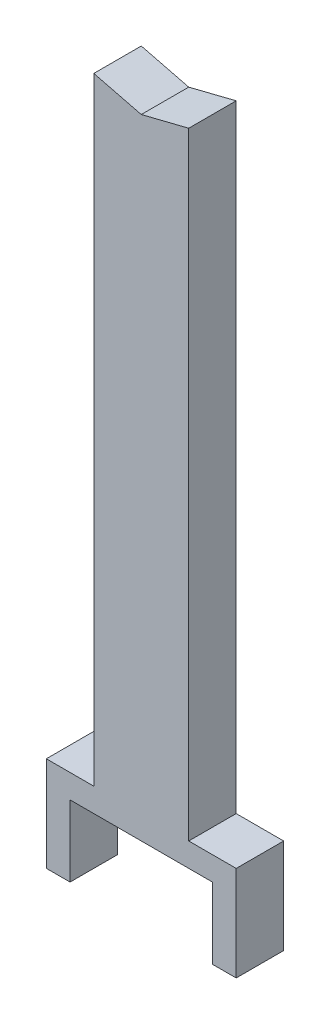
ISO-10303-21;
HEADER;
FILE_DESCRIPTION(('STEP AP214'),'2;1');
FILE_NAME('part.step','',(''),(''),'','','');
FILE_SCHEMA(('AUTOMOTIVE_DESIGN { 1 0 10303 214 1 1 1 1 }'));
ENDSEC;
DATA;
#1=APPLICATION_CONTEXT('core data for automotive mechanical design processes');
#2=APPLICATION_PROTOCOL_DEFINITION('international standard','automotive_design',2000,#1);
#3=PRODUCT_CONTEXT('',#1,'mechanical');
#4=PRODUCT('Part','Part','',(#3));
#5=PRODUCT_RELATED_PRODUCT_CATEGORY('part','',(#4));
#6=PRODUCT_DEFINITION_FORMATION('','',#4);
#7=PRODUCT_DEFINITION_CONTEXT('part definition',#1,'design');
#8=PRODUCT_DEFINITION('design','',#6,#7);
#9=PRODUCT_DEFINITION_SHAPE('','',#8);
#10=(LENGTH_UNIT() NAMED_UNIT(*) SI_UNIT(.MILLI.,.METRE.));
#11=(NAMED_UNIT(*) PLANE_ANGLE_UNIT() SI_UNIT($,.RADIAN.));
#12=(NAMED_UNIT(*) SI_UNIT($,.STERADIAN.) SOLID_ANGLE_UNIT());
#13=UNCERTAINTY_MEASURE_WITH_UNIT(LENGTH_MEASURE(1.E-05),#10,'distance_accuracy_value','');
#14=(GEOMETRIC_REPRESENTATION_CONTEXT(3) GLOBAL_UNCERTAINTY_ASSIGNED_CONTEXT((#13)) GLOBAL_UNIT_ASSIGNED_CONTEXT((#10,
#11,#12)) REPRESENTATION_CONTEXT('',''));
#15=CARTESIAN_POINT('',(0.,0.,0.));
#16=DIRECTION('',(0.,0.,1.));
#17=DIRECTION('',(1.,0.,0.));
#18=AXIS2_PLACEMENT_3D('',#15,#16,#17);
#19=CARTESIAN_POINT('',(0.,76.2,25.4));
#20=DIRECTION('',(0.,1.,0.));
#21=DIRECTION('',(-1.,0.,0.));
#22=AXIS2_PLACEMENT_3D('',#19,#20,#21);
#23=PLANE('',#22);
#24=DIRECTION('',(1.,0.,0.));
#25=VECTOR('',#24,1.);
#26=CARTESIAN_POINT('',(0.,76.2,-25.4));
#27=LINE('',#26,#25);
#28=CARTESIAN_POINT('',(-76.1999999999999,76.2,-25.4));
#29=VERTEX_POINT('',#28);
#30=CARTESIAN_POINT('',(76.2,76.2,-25.4));
#31=VERTEX_POINT('',#30);
#32=EDGE_CURVE('E174',#29,#31,#27,.T.);
#33=ORIENTED_EDGE('',*,*,#32,.T.);
#34=DIRECTION('',(0.,0.,-1.));
#35=VECTOR('',#34,1.);
#36=CARTESIAN_POINT('',(76.2,76.2,25.4));
#37=LINE('',#36,#35);
#38=CARTESIAN_POINT('',(76.2,76.2,25.4));
#39=VERTEX_POINT('',#38);
#40=EDGE_CURVE('E11',#39,#31,#37,.T.);
#41=ORIENTED_EDGE('',*,*,#40,.F.);
#42=DIRECTION('',(1.,0.,0.));
#43=VECTOR('',#42,1.);
#44=CARTESIAN_POINT('',(0.,76.2,25.4));
#45=LINE('',#44,#43);
#46=CARTESIAN_POINT('',(-76.1999999999999,76.2,25.4));
#47=VERTEX_POINT('',#46);
#48=EDGE_CURVE('E113',#47,#39,#45,.T.);
#49=ORIENTED_EDGE('',*,*,#48,.F.);
#50=DIRECTION('',(0.,0.,-1.));
#51=VECTOR('',#50,1.);
#52=CARTESIAN_POINT('',(-76.1999999999999,76.2,25.4));
#53=LINE('',#52,#51);
#54=EDGE_CURVE('E170',#47,#29,#53,.T.);
#55=ORIENTED_EDGE('',*,*,#54,.T.);
#56=EDGE_LOOP('',(#33,#41,#49,#55));
#57=FACE_BOUND('',#56,.T.);
#58=ADVANCED_FACE('F45',(#57),#23,.F.);
#59=CARTESIAN_POINT('',(76.2,0.,25.4));
#60=DIRECTION('',(-1.,0.,0.));
#61=DIRECTION('',(0.,-1.,0.));
#62=AXIS2_PLACEMENT_3D('',#59,#60,#61);
#63=PLANE('',#62);
#64=DIRECTION('',(0.,1.,0.));
#65=VECTOR('',#64,1.);
#66=CARTESIAN_POINT('',(76.2,0.,-25.4));
#67=LINE('',#66,#65);
#68=CARTESIAN_POINT('',(76.2,0.,-25.4));
#69=VERTEX_POINT('',#68);
#70=EDGE_CURVE('E178',#69,#31,#67,.T.);
#71=ORIENTED_EDGE('',*,*,#70,.F.);
#72=DIRECTION('',(0.,0.,-1.));
#73=VECTOR('',#72,1.);
#74=CARTESIAN_POINT('',(76.2,0.,25.4));
#75=LINE('',#74,#73);
#76=CARTESIAN_POINT('',(76.2,0.,25.4));
#77=VERTEX_POINT('',#76);
#78=EDGE_CURVE('E54',#77,#69,#75,.T.);
#79=ORIENTED_EDGE('',*,*,#78,.F.);
#80=DIRECTION('',(0.,1.,0.));
#81=VECTOR('',#80,1.);
#82=CARTESIAN_POINT('',(76.2,0.,25.4));
#83=LINE('',#82,#81);
#84=EDGE_CURVE('E263',#77,#39,#83,.T.);
#85=ORIENTED_EDGE('',*,*,#84,.T.);
#86=ORIENTED_EDGE('',*,*,#40,.T.);
#87=EDGE_LOOP('',(#71,#79,#85,#86));
#88=FACE_BOUND('',#87,.T.);
#89=ADVANCED_FACE('F262',(#88),#63,.T.);
#90=CARTESIAN_POINT('',(0.,0.,25.4));
#91=DIRECTION('',(0.,1.,0.));
#92=DIRECTION('',(-1.,0.,0.));
#93=AXIS2_PLACEMENT_3D('',#90,#91,#92);
#94=PLANE('',#93);
#95=DIRECTION('',(1.,0.,0.));
#96=VECTOR('',#95,1.);
#97=CARTESIAN_POINT('',(0.,0.,-25.4));
#98=LINE('',#97,#96);
#99=CARTESIAN_POINT('',(101.6,0.,-25.4));
#100=VERTEX_POINT('',#99);
#101=EDGE_CURVE('E182',#69,#100,#98,.T.);
#102=ORIENTED_EDGE('',*,*,#101,.T.);
#103=DIRECTION('',(0.,0.,-1.));
#104=VECTOR('',#103,1.);
#105=CARTESIAN_POINT('',(101.6,0.,25.4));
#106=LINE('',#105,#104);
#107=CARTESIAN_POINT('',(101.6,0.,25.4));
#108=VERTEX_POINT('',#107);
#109=EDGE_CURVE('E244',#108,#100,#106,.T.);
#110=ORIENTED_EDGE('',*,*,#109,.F.);
#111=DIRECTION('',(1.,0.,0.));
#112=VECTOR('',#111,1.);
#113=CARTESIAN_POINT('',(0.,0.,25.4));
#114=LINE('',#113,#112);
#115=EDGE_CURVE('E253',#77,#108,#114,.T.);
#116=ORIENTED_EDGE('',*,*,#115,.F.);
#117=ORIENTED_EDGE('',*,*,#78,.T.);
#118=EDGE_LOOP('',(#102,#110,#116,#117));
#119=FACE_BOUND('',#118,.T.);
#120=ADVANCED_FACE('F251',(#119),#94,.F.);
#121=CARTESIAN_POINT('',(101.6,0.,25.4));
#122=DIRECTION('',(-1.,0.,0.));
#123=DIRECTION('',(0.,-1.,0.));
#124=AXIS2_PLACEMENT_3D('',#121,#122,#123);
#125=PLANE('',#124);
#126=DIRECTION('',(0.,1.,0.));
#127=VECTOR('',#126,1.);
#128=CARTESIAN_POINT('',(101.6,0.,-25.4));
#129=LINE('',#128,#127);
#130=CARTESIAN_POINT('',(101.6,101.6,-25.4));
#131=VERTEX_POINT('',#130);
#132=EDGE_CURVE('E185',#100,#131,#129,.T.);
#133=ORIENTED_EDGE('',*,*,#132,.T.);
#134=DIRECTION('',(0.,0.,-1.));
#135=VECTOR('',#134,1.);
#136=CARTESIAN_POINT('',(101.6,101.6,25.4));
#137=LINE('',#136,#135);
#138=CARTESIAN_POINT('',(101.6,101.6,25.4));
#139=VERTEX_POINT('',#138);
#140=EDGE_CURVE('E240',#139,#131,#137,.T.);
#141=ORIENTED_EDGE('',*,*,#140,.F.);
#142=DIRECTION('',(0.,1.,0.));
#143=VECTOR('',#142,1.);
#144=CARTESIAN_POINT('',(101.6,0.,25.4));
#145=LINE('',#144,#143);
#146=EDGE_CURVE('E299',#108,#139,#145,.T.);
#147=ORIENTED_EDGE('',*,*,#146,.F.);
#148=ORIENTED_EDGE('',*,*,#109,.T.);
#149=EDGE_LOOP('',(#133,#141,#147,#148));
#150=FACE_BOUND('',#149,.T.);
#151=ADVANCED_FACE('F298',(#150),#125,.F.);
#152=CARTESIAN_POINT('',(3.88578058618806E-13,101.6,25.4));
#153=DIRECTION('',(0.,-1.,0.));
#154=DIRECTION('',(1.,0.,0.));
#155=AXIS2_PLACEMENT_3D('',#152,#153,#154);
#156=PLANE('',#155);
#157=DIRECTION('',(-1.,0.,0.));
#158=VECTOR('',#157,1.);
#159=CARTESIAN_POINT('',(3.88578058618806E-13,101.6,-25.4));
#160=LINE('',#159,#158);
#161=CARTESIAN_POINT('',(50.7999999999999,101.6,-25.4));
#162=VERTEX_POINT('',#161);
#163=EDGE_CURVE('E188',#131,#162,#160,.T.);
#164=ORIENTED_EDGE('',*,*,#163,.T.);
#165=DIRECTION('',(0.,0.,-1.));
#166=VECTOR('',#165,1.);
#167=CARTESIAN_POINT('',(50.7999999999999,101.6,25.4));
#168=LINE('',#167,#166);
#169=CARTESIAN_POINT('',(50.7999999999999,101.6,25.4));
#170=VERTEX_POINT('',#169);
#171=EDGE_CURVE('E236',#170,#162,#168,.T.);
#172=ORIENTED_EDGE('',*,*,#171,.F.);
#173=DIRECTION('',(-1.,0.,0.));
#174=VECTOR('',#173,1.);
#175=CARTESIAN_POINT('',(3.88578058618806E-13,101.6,25.4));
#176=LINE('',#175,#174);
#177=EDGE_CURVE('E294',#139,#170,#176,.T.);
#178=ORIENTED_EDGE('',*,*,#177,.F.);
#179=ORIENTED_EDGE('',*,*,#140,.T.);
#180=EDGE_LOOP('',(#164,#172,#178,#179));
#181=FACE_BOUND('',#180,.T.);
#182=ADVANCED_FACE('F293',(#181),#156,.F.);
#183=CARTESIAN_POINT('',(50.7999999999999,0.,25.4));
#184=DIRECTION('',(-1.,0.,0.));
#185=DIRECTION('',(0.,-1.,0.));
#186=AXIS2_PLACEMENT_3D('',#183,#184,#185);
#187=PLANE('',#186);
#188=DIRECTION('',(0.,1.,0.));
#189=VECTOR('',#188,1.);
#190=CARTESIAN_POINT('',(50.7999999999999,0.,-25.4));
#191=LINE('',#190,#189);
#192=CARTESIAN_POINT('',(50.8,762.254,-25.4));
#193=VERTEX_POINT('',#192);
#194=EDGE_CURVE('E191',#162,#193,#191,.T.);
#195=ORIENTED_EDGE('',*,*,#194,.T.);
#196=DIRECTION('',(0.,0.,-1.));
#197=VECTOR('',#196,1.);
#198=CARTESIAN_POINT('',(50.8,762.254,25.4));
#199=LINE('',#198,#197);
#200=CARTESIAN_POINT('',(50.8,762.254,25.4));
#201=VERTEX_POINT('',#200);
#202=EDGE_CURVE('E233',#201,#193,#199,.T.);
#203=ORIENTED_EDGE('',*,*,#202,.F.);
#204=DIRECTION('',(0.,1.,0.));
#205=VECTOR('',#204,1.);
#206=CARTESIAN_POINT('',(50.7999999999999,0.,25.4));
#207=LINE('',#206,#205);
#208=EDGE_CURVE('E290',#170,#201,#207,.T.);
#209=ORIENTED_EDGE('',*,*,#208,.F.);
#210=ORIENTED_EDGE('',*,*,#171,.T.);
#211=EDGE_LOOP('',(#195,#203,#209,#210));
#212=FACE_BOUND('',#211,.T.);
#213=ADVANCED_FACE('F288',(#212),#187,.F.);
#214=CARTESIAN_POINT('',(-176.365647058824,705.462588235294,25.4));
#215=DIRECTION('',(-0.242535625036334,0.970142500145332,0.));
#216=DIRECTION('',(-0.970142500145332,-0.242535625036334,0.));
#217=AXIS2_PLACEMENT_3D('',#214,#215,#216);
#218=PLANE('',#217);
#219=DIRECTION('',(0.970142500145332,0.242535625036334,0.));
#220=VECTOR('',#219,1.);
#221=CARTESIAN_POINT('',(-176.365647058824,705.462588235294,-25.4));
#222=LINE('',#221,#220);
#223=CARTESIAN_POINT('',(0.,749.554,-25.4));
#224=VERTEX_POINT('',#223);
#225=EDGE_CURVE('E195',#224,#193,#222,.T.);
#226=ORIENTED_EDGE('',*,*,#225,.F.);
#227=DIRECTION('',(0.,0.,-1.));
#228=VECTOR('',#227,1.);
#229=CARTESIAN_POINT('',(0.,749.554,25.4));
#230=LINE('',#229,#228);
#231=CARTESIAN_POINT('',(0.,749.554,25.4));
#232=VERTEX_POINT('',#231);
#233=EDGE_CURVE('E230',#232,#224,#230,.T.);
#234=ORIENTED_EDGE('',*,*,#233,.F.);
#235=DIRECTION('',(0.970142500145332,0.242535625036334,0.));
#236=VECTOR('',#235,1.);
#237=CARTESIAN_POINT('',(-176.365647058824,705.462588235294,25.4));
#238=LINE('',#237,#236);
#239=EDGE_CURVE('E285',#232,#201,#238,.T.);
#240=ORIENTED_EDGE('',*,*,#239,.T.);
#241=ORIENTED_EDGE('',*,*,#202,.T.);
#242=EDGE_LOOP('',(#226,#234,#240,#241));
#243=FACE_BOUND('',#242,.T.);
#244=ADVANCED_FACE('F281',(#243),#218,.T.);
#245=CARTESIAN_POINT('',(176.365647058824,705.462588235294,25.4));
#246=DIRECTION('',(0.242535625036334,0.970142500145332,0.));
#247=DIRECTION('',(-0.970142500145332,0.242535625036334,0.));
#248=AXIS2_PLACEMENT_3D('',#245,#246,#247);
#249=PLANE('',#248);
#250=DIRECTION('',(0.970142500145332,-0.242535625036334,0.));
#251=VECTOR('',#250,1.);
#252=CARTESIAN_POINT('',(176.365647058824,705.462588235294,-25.4));
#253=LINE('',#252,#251);
#254=CARTESIAN_POINT('',(-50.8,762.254,-25.4));
#255=VERTEX_POINT('',#254);
#256=EDGE_CURVE('E199',#255,#224,#253,.T.);
#257=ORIENTED_EDGE('',*,*,#256,.F.);
#258=DIRECTION('',(0.,0.,-1.));
#259=VECTOR('',#258,1.);
#260=CARTESIAN_POINT('',(-50.8,762.254,25.4));
#261=LINE('',#260,#259);
#262=CARTESIAN_POINT('',(-50.8,762.254,25.4));
#263=VERTEX_POINT('',#262);
#264=EDGE_CURVE('E227',#263,#255,#261,.T.);
#265=ORIENTED_EDGE('',*,*,#264,.F.);
#266=DIRECTION('',(0.970142500145332,-0.242535625036334,0.));
#267=VECTOR('',#266,1.);
#268=CARTESIAN_POINT('',(176.365647058824,705.462588235294,25.4));
#269=LINE('',#268,#267);
#270=EDGE_CURVE('E312',#263,#232,#269,.T.);
#271=ORIENTED_EDGE('',*,*,#270,.T.);
#272=ORIENTED_EDGE('',*,*,#233,.T.);
#273=EDGE_LOOP('',(#257,#265,#271,#272));
#274=FACE_BOUND('',#273,.T.);
#275=ADVANCED_FACE('F277',(#274),#249,.T.);
#276=CARTESIAN_POINT('',(-50.7999999999999,0.,25.4));
#277=DIRECTION('',(-1.,0.,0.));
#278=DIRECTION('',(0.,-1.,0.));
#279=AXIS2_PLACEMENT_3D('',#276,#277,#278);
#280=PLANE('',#279);
#281=DIRECTION('',(0.,1.,0.));
#282=VECTOR('',#281,1.);
#283=CARTESIAN_POINT('',(-50.7999999999999,0.,-25.4));
#284=LINE('',#283,#282);
#285=CARTESIAN_POINT('',(-50.7999999999999,101.6,-25.4));
#286=VERTEX_POINT('',#285);
#287=EDGE_CURVE('E203',#286,#255,#284,.T.);
#288=ORIENTED_EDGE('',*,*,#287,.F.);
#289=DIRECTION('',(0.,0.,-1.));
#290=VECTOR('',#289,1.);
#291=CARTESIAN_POINT('',(-50.7999999999999,101.6,25.4));
#292=LINE('',#291,#290);
#293=CARTESIAN_POINT('',(-50.7999999999999,101.6,25.4));
#294=VERTEX_POINT('',#293);
#295=EDGE_CURVE('E224',#294,#286,#292,.T.);
#296=ORIENTED_EDGE('',*,*,#295,.F.);
#297=DIRECTION('',(0.,1.,0.));
#298=VECTOR('',#297,1.);
#299=CARTESIAN_POINT('',(-50.7999999999999,0.,25.4));
#300=LINE('',#299,#298);
#301=EDGE_CURVE('E273',#294,#263,#300,.T.);
#302=ORIENTED_EDGE('',*,*,#301,.T.);
#303=ORIENTED_EDGE('',*,*,#264,.T.);
#304=EDGE_LOOP('',(#288,#296,#302,#303));
#305=FACE_BOUND('',#304,.T.);
#306=ADVANCED_FACE('F271',(#305),#280,.T.);
#307=CARTESIAN_POINT('',(0.,101.6,25.4));
#308=DIRECTION('',(0.,1.,0.));
#309=DIRECTION('',(0.,0.,1.));
#310=AXIS2_PLACEMENT_3D('',#307,#308,#309);
#311=PLANE('',#310);
#312=DIRECTION('',(1.,0.,0.));
#313=VECTOR('',#312,1.);
#314=CARTESIAN_POINT('',(0.,101.6,-25.4));
#315=LINE('',#314,#313);
#316=CARTESIAN_POINT('',(-101.6,101.6,-25.4));
#317=VERTEX_POINT('',#316);
#318=EDGE_CURVE('E207',#317,#286,#315,.T.);
#319=ORIENTED_EDGE('',*,*,#318,.F.);
#320=DIRECTION('',(0.,0.,-1.));
#321=VECTOR('',#320,1.);
#322=CARTESIAN_POINT('',(-101.6,101.6,25.4));
#323=LINE('',#322,#321);
#324=CARTESIAN_POINT('',(-101.6,101.6,25.4));
#325=VERTEX_POINT('',#324);
#326=EDGE_CURVE('E156',#325,#317,#323,.T.);
#327=ORIENTED_EDGE('',*,*,#326,.F.);
#328=DIRECTION('',(1.,0.,0.));
#329=VECTOR('',#328,1.);
#330=CARTESIAN_POINT('',(0.,101.6,25.4));
#331=LINE('',#330,#329);
#332=EDGE_CURVE('E163',#325,#294,#331,.T.);
#333=ORIENTED_EDGE('',*,*,#332,.T.);
#334=ORIENTED_EDGE('',*,*,#295,.T.);
#335=EDGE_LOOP('',(#319,#327,#333,#334));
#336=FACE_BOUND('',#335,.T.);
#337=ADVANCED_FACE('F268',(#336),#311,.T.);
#338=CARTESIAN_POINT('',(-101.6,0.,25.4));
#339=DIRECTION('',(-1.,0.,0.));
#340=DIRECTION('',(0.,0.,1.));
#341=AXIS2_PLACEMENT_3D('',#338,#339,#340);
#342=PLANE('',#341);
#343=DIRECTION('',(0.,1.,0.));
#344=VECTOR('',#343,1.);
#345=CARTESIAN_POINT('',(-101.6,0.,-25.4));
#346=LINE('',#345,#344);
#347=CARTESIAN_POINT('',(-101.6,0.,-25.4));
#348=VERTEX_POINT('',#347);
#349=EDGE_CURVE('E150',#348,#317,#346,.T.);
#350=ORIENTED_EDGE('',*,*,#349,.F.);
#351=DIRECTION('',(0.,0.,-1.));
#352=VECTOR('',#351,1.);
#353=CARTESIAN_POINT('',(-101.6,0.,25.4));
#354=LINE('',#353,#352);
#355=CARTESIAN_POINT('',(-101.6,0.,25.4));
#356=VERTEX_POINT('',#355);
#357=EDGE_CURVE('E145',#356,#348,#354,.T.);
#358=ORIENTED_EDGE('',*,*,#357,.F.);
#359=DIRECTION('',(0.,1.,0.));
#360=VECTOR('',#359,1.);
#361=CARTESIAN_POINT('',(-101.6,0.,25.4));
#362=LINE('',#361,#360);
#363=EDGE_CURVE('E148',#356,#325,#362,.T.);
#364=ORIENTED_EDGE('',*,*,#363,.T.);
#365=ORIENTED_EDGE('',*,*,#326,.T.);
#366=EDGE_LOOP('',(#350,#358,#364,#365));
#367=FACE_BOUND('',#366,.T.);
#368=ADVANCED_FACE('F147',(#367),#342,.T.);
#369=CARTESIAN_POINT('',(0.,0.,25.4));
#370=DIRECTION('',(0.,-1.,0.));
#371=DIRECTION('',(1.,0.,0.));
#372=AXIS2_PLACEMENT_3D('',#369,#370,#371);
#373=PLANE('',#372);
#374=DIRECTION('',(-1.,0.,0.));
#375=VECTOR('',#374,1.);
#376=CARTESIAN_POINT('',(0.,0.,-25.4));
#377=LINE('',#376,#375);
#378=CARTESIAN_POINT('',(-76.1999999999999,0.,-25.4));
#379=VERTEX_POINT('',#378);
#380=EDGE_CURVE('E213',#379,#348,#377,.T.);
#381=ORIENTED_EDGE('',*,*,#380,.F.);
#382=DIRECTION('',(0.,0.,-1.));
#383=VECTOR('',#382,1.);
#384=CARTESIAN_POINT('',(-76.1999999999999,0.,25.4));
#385=LINE('',#384,#383);
#386=CARTESIAN_POINT('',(-76.1999999999999,0.,25.4));
#387=VERTEX_POINT('',#386);
#388=EDGE_CURVE('E104',#387,#379,#385,.T.);
#389=ORIENTED_EDGE('',*,*,#388,.F.);
#390=DIRECTION('',(-1.,0.,0.));
#391=VECTOR('',#390,1.);
#392=CARTESIAN_POINT('',(0.,0.,25.4));
#393=LINE('',#392,#391);
#394=EDGE_CURVE('E160',#387,#356,#393,.T.);
#395=ORIENTED_EDGE('',*,*,#394,.T.);
#396=ORIENTED_EDGE('',*,*,#357,.T.);
#397=EDGE_LOOP('',(#381,#389,#395,#396));
#398=FACE_BOUND('',#397,.T.);
#399=ADVANCED_FACE('F166',(#398),#373,.T.);
#400=CARTESIAN_POINT('',(-76.1999999999999,0.,25.4));
#401=DIRECTION('',(-1.,0.,0.));
#402=DIRECTION('',(0.,-1.,0.));
#403=AXIS2_PLACEMENT_3D('',#400,#401,#402);
#404=PLANE('',#403);
#405=DIRECTION('',(0.,1.,0.));
#406=VECTOR('',#405,1.);
#407=CARTESIAN_POINT('',(-76.1999999999999,0.,-25.4));
#408=LINE('',#407,#406);
#409=EDGE_CURVE('E107',#379,#29,#408,.T.);
#410=ORIENTED_EDGE('',*,*,#409,.T.);
#411=ORIENTED_EDGE('',*,*,#54,.F.);
#412=DIRECTION('',(0.,1.,0.));
#413=VECTOR('',#412,1.);
#414=CARTESIAN_POINT('',(-76.1999999999999,0.,25.4));
#415=LINE('',#414,#413);
#416=EDGE_CURVE('E62',#387,#47,#415,.T.);
#417=ORIENTED_EDGE('',*,*,#416,.F.);
#418=ORIENTED_EDGE('',*,*,#388,.T.);
#419=EDGE_LOOP('',(#410,#411,#417,#418));
#420=FACE_BOUND('',#419,.T.);
#421=ADVANCED_FACE('F414',(#420),#404,.F.);
#422=CARTESIAN_POINT('',(0.,0.,25.4));
#423=DIRECTION('',(0.,0.,1.));
#424=DIRECTION('',(1.,0.,0.));
#425=AXIS2_PLACEMENT_3D('',#422,#423,#424);
#426=PLANE('',#425);
#427=ORIENTED_EDGE('',*,*,#48,.T.);
#428=ORIENTED_EDGE('',*,*,#84,.F.);
#429=ORIENTED_EDGE('',*,*,#115,.T.);
#430=ORIENTED_EDGE('',*,*,#146,.T.);
#431=ORIENTED_EDGE('',*,*,#177,.T.);
#432=ORIENTED_EDGE('',*,*,#208,.T.);
#433=ORIENTED_EDGE('',*,*,#239,.F.);
#434=ORIENTED_EDGE('',*,*,#270,.F.);
#435=ORIENTED_EDGE('',*,*,#301,.F.);
#436=ORIENTED_EDGE('',*,*,#332,.F.);
#437=ORIENTED_EDGE('',*,*,#363,.F.);
#438=ORIENTED_EDGE('',*,*,#394,.F.);
#439=ORIENTED_EDGE('',*,*,#416,.T.);
#440=EDGE_LOOP('',(#427,#428,#429,#430,#431,#432,#433,#434,#435,#436,#437,#438,#439));
#441=FACE_BOUND('',#440,.T.);
#442=ADVANCED_FACE('F159',(#441),#426,.T.);
#443=CARTESIAN_POINT('',(0.,0.,-25.4));
#444=DIRECTION('',(0.,0.,1.));
#445=DIRECTION('',(1.,0.,0.));
#446=AXIS2_PLACEMENT_3D('',#443,#444,#445);
#447=PLANE('',#446);
#448=ORIENTED_EDGE('',*,*,#32,.F.);
#449=ORIENTED_EDGE('',*,*,#409,.F.);
#450=ORIENTED_EDGE('',*,*,#380,.T.);
#451=ORIENTED_EDGE('',*,*,#349,.T.);
#452=ORIENTED_EDGE('',*,*,#318,.T.);
#453=ORIENTED_EDGE('',*,*,#287,.T.);
#454=ORIENTED_EDGE('',*,*,#256,.T.);
#455=ORIENTED_EDGE('',*,*,#225,.T.);
#456=ORIENTED_EDGE('',*,*,#194,.F.);
#457=ORIENTED_EDGE('',*,*,#163,.F.);
#458=ORIENTED_EDGE('',*,*,#132,.F.);
#459=ORIENTED_EDGE('',*,*,#101,.F.);
#460=ORIENTED_EDGE('',*,*,#70,.T.);
#461=EDGE_LOOP('',(#448,#449,#450,#451,#452,#453,#454,#455,#456,#457,#458,#459,#460));
#462=FACE_BOUND('',#461,.T.);
#463=ADVANCED_FACE('F260',(#462),#447,.F.);
#464=CLOSED_SHELL('',(#58,#89,#120,#151,#182,#213,#244,#275,#306,#337,#368,#399,#421,#442,#463));
#465=MANIFOLD_SOLID_BREP('B2',#464);
#466=ADVANCED_BREP_SHAPE_REPRESENTATION('',(#18,#465),#14);
#467=SHAPE_DEFINITION_REPRESENTATION(#9,#466);
ENDSEC;
END-ISO-10303-21;
